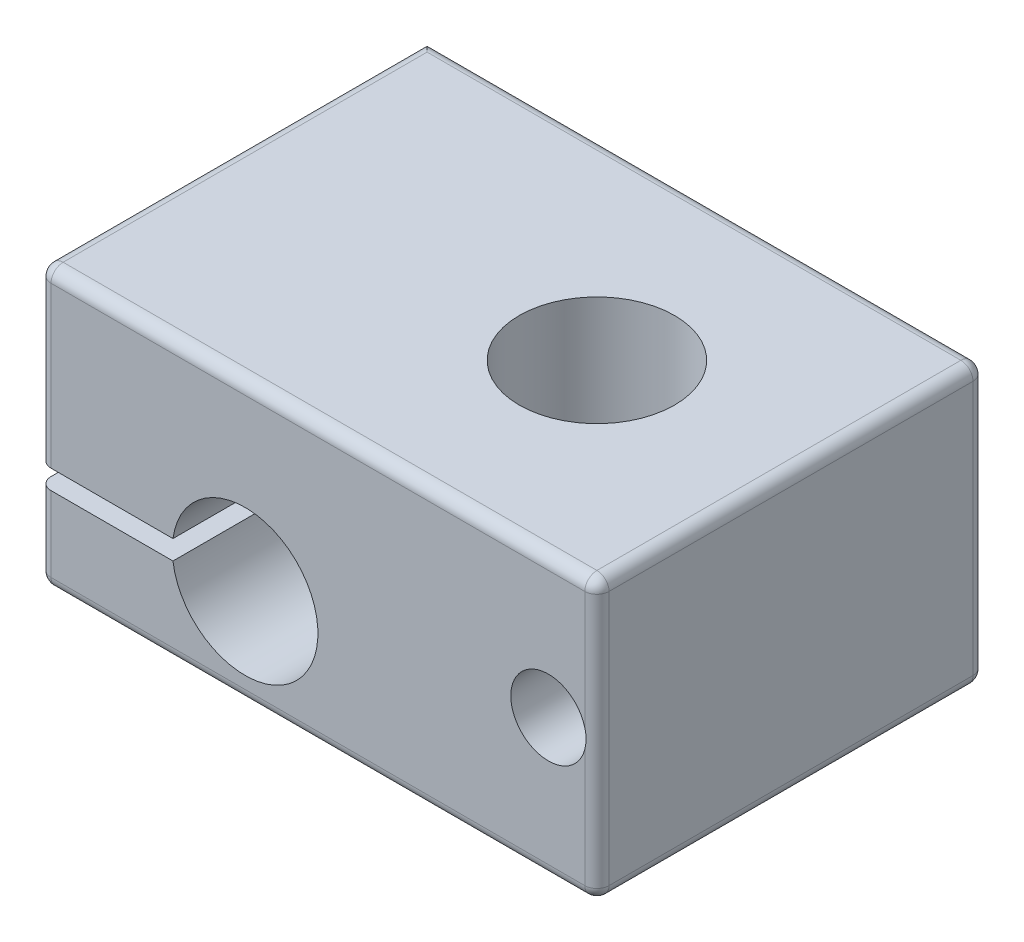
ISO-10303-21;
HEADER;
FILE_DESCRIPTION(('STEP AP214'),'2;1');
FILE_NAME('part.step','',(''),(''),'','','');
FILE_SCHEMA(('AUTOMOTIVE_DESIGN { 1 0 10303 214 1 1 1 1 }'));
ENDSEC;
DATA;
#1=APPLICATION_CONTEXT('core data for automotive mechanical design processes');
#2=APPLICATION_PROTOCOL_DEFINITION('international standard','automotive_design',2000,#1);
#3=PRODUCT_CONTEXT('',#1,'mechanical');
#4=PRODUCT('Part','Part','',(#3));
#5=PRODUCT_RELATED_PRODUCT_CATEGORY('part','',(#4));
#6=PRODUCT_DEFINITION_FORMATION('','',#4);
#7=PRODUCT_DEFINITION_CONTEXT('part definition',#1,'design');
#8=PRODUCT_DEFINITION('design','',#6,#7);
#9=PRODUCT_DEFINITION_SHAPE('','',#8);
#10=(LENGTH_UNIT() NAMED_UNIT(*) SI_UNIT(.MILLI.,.METRE.));
#11=(NAMED_UNIT(*) PLANE_ANGLE_UNIT() SI_UNIT($,.RADIAN.));
#12=(NAMED_UNIT(*) SI_UNIT($,.STERADIAN.) SOLID_ANGLE_UNIT());
#13=UNCERTAINTY_MEASURE_WITH_UNIT(LENGTH_MEASURE(1.E-05),#10,'distance_accuracy_value','');
#14=(GEOMETRIC_REPRESENTATION_CONTEXT(3) GLOBAL_UNCERTAINTY_ASSIGNED_CONTEXT((#13)) GLOBAL_UNIT_ASSIGNED_CONTEXT((#10,
#11,#12)) REPRESENTATION_CONTEXT('',''));
#15=CARTESIAN_POINT('',(0.,0.,0.));
#16=DIRECTION('',(0.,0.,1.));
#17=DIRECTION('',(1.,0.,0.));
#18=AXIS2_PLACEMENT_3D('',#15,#16,#17);
#19=CARTESIAN_POINT('',(-11.5,11.5,8.));
#20=DIRECTION('',(1.,0.,0.));
#21=DIRECTION('',(0.,0.,-1.));
#22=AXIS2_PLACEMENT_3D('',#19,#20,#21);
#23=PLANE('',#22);
#24=DIRECTION('',(0.,0.,1.));
#25=VECTOR('',#24,1.);
#26=CARTESIAN_POINT('',(-11.5,3.6,-8.00000000000001));
#27=LINE('',#26,#25);
#28=CARTESIAN_POINT('',(-11.5,3.6,-7.5));
#29=VERTEX_POINT('',#28);
#30=CARTESIAN_POINT('',(-11.5,3.6,7.5));
#31=VERTEX_POINT('',#30);
#32=EDGE_CURVE('E240',#29,#31,#27,.T.);
#33=ORIENTED_EDGE('',*,*,#32,.F.);
#34=DIRECTION('',(0.,-1.,0.));
#35=VECTOR('',#34,1.);
#36=CARTESIAN_POINT('',(-11.5,11.5,-7.5));
#37=LINE('',#36,#35);
#38=CARTESIAN_POINT('',(-11.5,0.5,-7.5));
#39=VERTEX_POINT('',#38);
#40=EDGE_CURVE('E295',#29,#39,#37,.T.);
#41=ORIENTED_EDGE('',*,*,#40,.T.);
#42=DIRECTION('',(0.,0.,1.));
#43=VECTOR('',#42,1.);
#44=CARTESIAN_POINT('',(-11.5,0.5,8.));
#45=LINE('',#44,#43);
#46=CARTESIAN_POINT('',(-11.5,0.5,7.5));
#47=VERTEX_POINT('',#46);
#48=EDGE_CURVE('E292',#39,#47,#45,.T.);
#49=ORIENTED_EDGE('',*,*,#48,.T.);
#50=DIRECTION('',(0.,-1.,0.));
#51=VECTOR('',#50,1.);
#52=CARTESIAN_POINT('',(-11.5,11.5,7.5));
#53=LINE('',#52,#51);
#54=EDGE_CURVE('E290',#47,#31,#53,.F.);
#55=ORIENTED_EDGE('',*,*,#54,.T.);
#56=EDGE_LOOP('',(#33,#41,#49,#55));
#57=FACE_BOUND('',#56,.T.);
#58=ADVANCED_FACE('F57',(#57),#23,.F.);
#59=DIRECTION('',(0.,-1.,0.));
#60=VECTOR('',#59,1.);
#61=CARTESIAN_POINT('',(-11.5,11.5,7.5));
#62=LINE('',#61,#60);
#63=CARTESIAN_POINT('',(-11.5,4.4,7.5));
#64=VERTEX_POINT('',#63);
#65=CARTESIAN_POINT('',(-11.5,11.,7.5));
#66=VERTEX_POINT('',#65);
#67=EDGE_CURVE('E74',#64,#66,#62,.F.);
#68=ORIENTED_EDGE('',*,*,#67,.T.);
#69=DIRECTION('',(0.,0.,1.));
#70=VECTOR('',#69,1.);
#71=CARTESIAN_POINT('',(-11.5,11.,-8.));
#72=LINE('',#71,#70);
#73=CARTESIAN_POINT('',(-11.5,11.,-8.));
#74=VERTEX_POINT('',#73);
#75=EDGE_CURVE('E325',#66,#74,#72,.F.);
#76=ORIENTED_EDGE('',*,*,#75,.T.);
#77=DIRECTION('',(0.,-1.,0.));
#78=VECTOR('',#77,1.);
#79=CARTESIAN_POINT('',(-11.5,11.5,-8.));
#80=LINE('',#79,#78);
#81=CARTESIAN_POINT('',(-11.5,4.4,-8.));
#82=VERTEX_POINT('',#81);
#83=EDGE_CURVE('E239',#74,#82,#80,.T.);
#84=ORIENTED_EDGE('',*,*,#83,.T.);
#85=DIRECTION('',(0.,0.,1.));
#86=VECTOR('',#85,1.);
#87=CARTESIAN_POINT('',(-11.5,4.4,-8.00000000000001));
#88=LINE('',#87,#86);
#89=EDGE_CURVE('E204',#82,#64,#88,.T.);
#90=ORIENTED_EDGE('',*,*,#89,.T.);
#91=EDGE_LOOP('',(#68,#76,#84,#90));
#92=FACE_BOUND('',#91,.T.);
#93=ADVANCED_FACE('F371',(#92),#23,.F.);
#94=CARTESIAN_POINT('',(11.5,11.5,8.));
#95=DIRECTION('',(0.,0.,-1.));
#96=DIRECTION('',(-1.,0.,0.));
#97=AXIS2_PLACEMENT_3D('',#94,#95,#96);
#98=PLANE('',#97);
#99=DIRECTION('',(1.,0.,0.));
#100=VECTOR('',#99,1.);
#101=CARTESIAN_POINT('',(11.5,0.5,8.));
#102=LINE('',#101,#100);
#103=CARTESIAN_POINT('',(-11.,0.5,8.));
#104=VERTEX_POINT('',#103);
#105=CARTESIAN_POINT('',(11.,0.5,8.));
#106=VERTEX_POINT('',#105);
#107=EDGE_CURVE('E306',#104,#106,#102,.T.);
#108=ORIENTED_EDGE('',*,*,#107,.T.);
#109=DIRECTION('',(0.,-1.,0.));
#110=VECTOR('',#109,1.);
#111=CARTESIAN_POINT('',(11.,11.5,8.));
#112=LINE('',#111,#110);
#113=CARTESIAN_POINT('',(11.,5.35948751620466,8.));
#114=VERTEX_POINT('',#113);
#115=EDGE_CURVE('E309',#106,#114,#112,.F.);
#116=ORIENTED_EDGE('',*,*,#115,.T.);
#117=CARTESIAN_POINT('',(9.5,5.75,8.));
#118=DIRECTION('',(0.,0.,1.));
#119=DIRECTION('',(1.,0.,0.));
#120=AXIS2_PLACEMENT_3D('',#117,#118,#119);
#121=CIRCLE('',#120,1.55);
#122=CARTESIAN_POINT('',(11.,6.14051248379534,8.));
#123=VERTEX_POINT('',#122);
#124=EDGE_CURVE('E249',#123,#114,#121,.T.);
#125=ORIENTED_EDGE('',*,*,#124,.F.);
#126=DIRECTION('',(0.,-1.,0.));
#127=VECTOR('',#126,1.);
#128=CARTESIAN_POINT('',(11.,11.5,8.));
#129=LINE('',#128,#127);
#130=CARTESIAN_POINT('',(11.,11.,8.));
#131=VERTEX_POINT('',#130);
#132=EDGE_CURVE('E302',#123,#131,#129,.F.);
#133=ORIENTED_EDGE('',*,*,#132,.T.);
#134=DIRECTION('',(1.,0.,0.));
#135=VECTOR('',#134,1.);
#136=CARTESIAN_POINT('',(-11.5,11.,8.));
#137=LINE('',#136,#135);
#138=CARTESIAN_POINT('',(-11.,11.,8.));
#139=VERTEX_POINT('',#138);
#140=EDGE_CURVE('E299',#131,#139,#137,.F.);
#141=ORIENTED_EDGE('',*,*,#140,.T.);
#142=DIRECTION('',(0.,-1.,0.));
#143=VECTOR('',#142,1.);
#144=CARTESIAN_POINT('',(-11.,11.5,8.));
#145=LINE('',#144,#143);
#146=CARTESIAN_POINT('',(-11.,4.4,8.));
#147=VERTEX_POINT('',#146);
#148=EDGE_CURVE('E297',#139,#147,#145,.T.);
#149=ORIENTED_EDGE('',*,*,#148,.T.);
#150=DIRECTION('',(-1.,0.,0.));
#151=VECTOR('',#150,1.);
#152=CARTESIAN_POINT('',(-5.9732137494637,4.4,8.));
#153=LINE('',#152,#151);
#154=CARTESIAN_POINT('',(-5.9732137494637,4.4,8.));
#155=VERTEX_POINT('',#154);
#156=EDGE_CURVE('E223',#155,#147,#153,.T.);
#157=ORIENTED_EDGE('',*,*,#156,.F.);
#158=CARTESIAN_POINT('',(-3.,4.,8.));
#159=DIRECTION('',(0.,0.,1.));
#160=DIRECTION('',(1.,0.,0.));
#161=AXIS2_PLACEMENT_3D('',#158,#159,#160);
#162=CIRCLE('',#161,3.);
#163=CARTESIAN_POINT('',(-5.9732137494637,3.6,8.));
#164=VERTEX_POINT('',#163);
#165=EDGE_CURVE('E201',#164,#155,#162,.T.);
#166=ORIENTED_EDGE('',*,*,#165,.F.);
#167=DIRECTION('',(1.,0.,0.));
#168=VECTOR('',#167,1.);
#169=CARTESIAN_POINT('',(-11.5,3.6,8.));
#170=LINE('',#169,#168);
#171=CARTESIAN_POINT('',(-11.,3.6,8.));
#172=VERTEX_POINT('',#171);
#173=EDGE_CURVE('E218',#172,#164,#170,.T.);
#174=ORIENTED_EDGE('',*,*,#173,.F.);
#175=DIRECTION('',(0.,-1.,0.));
#176=VECTOR('',#175,1.);
#177=CARTESIAN_POINT('',(-11.,11.5,8.));
#178=LINE('',#177,#176);
#179=EDGE_CURVE('E304',#172,#104,#178,.T.);
#180=ORIENTED_EDGE('',*,*,#179,.T.);
#181=EDGE_LOOP('',(#108,#116,#125,#133,#141,#149,#157,#166,#174,#180));
#182=FACE_BOUND('',#181,.T.);
#183=ADVANCED_FACE('F367',(#182),#98,.F.);
#184=CARTESIAN_POINT('',(11.5,11.5,8.));
#185=DIRECTION('',(-1.,0.,0.));
#186=DIRECTION('',(0.,0.,1.));
#187=AXIS2_PLACEMENT_3D('',#184,#185,#186);
#188=PLANE('',#187);
#189=DIRECTION('',(0.,0.,-1.));
#190=VECTOR('',#189,1.);
#191=CARTESIAN_POINT('',(11.5,0.5,8.));
#192=LINE('',#191,#190);
#193=CARTESIAN_POINT('',(11.5,0.5,7.5));
#194=VERTEX_POINT('',#193);
#195=CARTESIAN_POINT('',(11.5,0.5,-7.50000000000001));
#196=VERTEX_POINT('',#195);
#197=EDGE_CURVE('E259',#194,#196,#192,.T.);
#198=ORIENTED_EDGE('',*,*,#197,.T.);
#199=DIRECTION('',(0.,-1.,0.));
#200=VECTOR('',#199,1.);
#201=CARTESIAN_POINT('',(11.5,11.5,-7.50000000000001));
#202=LINE('',#201,#200);
#203=CARTESIAN_POINT('',(11.5,11.,-7.50000000000001));
#204=VERTEX_POINT('',#203);
#205=EDGE_CURVE('E263',#196,#204,#202,.F.);
#206=ORIENTED_EDGE('',*,*,#205,.T.);
#207=DIRECTION('',(0.,0.,-1.));
#208=VECTOR('',#207,1.);
#209=CARTESIAN_POINT('',(11.5,11.,8.));
#210=LINE('',#209,#208);
#211=CARTESIAN_POINT('',(11.5,11.,7.5));
#212=VERTEX_POINT('',#211);
#213=EDGE_CURVE('E257',#204,#212,#210,.F.);
#214=ORIENTED_EDGE('',*,*,#213,.T.);
#215=DIRECTION('',(0.,-1.,0.));
#216=VECTOR('',#215,1.);
#217=CARTESIAN_POINT('',(11.5,11.5,7.5));
#218=LINE('',#217,#216);
#219=EDGE_CURVE('E255',#212,#194,#218,.T.);
#220=ORIENTED_EDGE('',*,*,#219,.T.);
#221=EDGE_LOOP('',(#198,#206,#214,#220));
#222=FACE_BOUND('',#221,.T.);
#223=ADVANCED_FACE('F364',(#222),#188,.F.);
#224=CARTESIAN_POINT('',(11.5,11.5,-8.00000000000001));
#225=DIRECTION('',(0.,0.,1.));
#226=DIRECTION('',(1.,0.,0.));
#227=AXIS2_PLACEMENT_3D('',#224,#225,#226);
#228=PLANE('',#227);
#229=ORIENTED_EDGE('',*,*,#83,.F.);
#230=DIRECTION('',(-1.,0.,0.));
#231=VECTOR('',#230,1.);
#232=CARTESIAN_POINT('',(11.5,11.,-8.00000000000001));
#233=LINE('',#232,#231);
#234=CARTESIAN_POINT('',(11.,11.,-8.00000000000001));
#235=VERTEX_POINT('',#234);
#236=EDGE_CURVE('E288',#74,#235,#233,.F.);
#237=ORIENTED_EDGE('',*,*,#236,.T.);
#238=DIRECTION('',(0.,-1.,0.));
#239=VECTOR('',#238,1.);
#240=CARTESIAN_POINT('',(11.,11.5,-8.00000000000001));
#241=LINE('',#240,#239);
#242=CARTESIAN_POINT('',(11.,6.14051248379545,-8.00000000000001));
#243=VERTEX_POINT('',#242);
#244=EDGE_CURVE('E286',#235,#243,#241,.T.);
#245=ORIENTED_EDGE('',*,*,#244,.T.);
#246=CARTESIAN_POINT('',(9.5,5.75,-8.00000000000001));
#247=DIRECTION('',(0.,0.,1.));
#248=DIRECTION('',(1.,0.,0.));
#249=AXIS2_PLACEMENT_3D('',#246,#247,#248);
#250=CIRCLE('',#249,1.55);
#251=CARTESIAN_POINT('',(11.,5.35948751620455,-8.00000000000001));
#252=VERTEX_POINT('',#251);
#253=EDGE_CURVE('E233',#243,#252,#250,.T.);
#254=ORIENTED_EDGE('',*,*,#253,.T.);
#255=DIRECTION('',(0.,-1.,0.));
#256=VECTOR('',#255,1.);
#257=CARTESIAN_POINT('',(11.,11.5,-8.00000000000001));
#258=LINE('',#257,#256);
#259=CARTESIAN_POINT('',(11.,0.5,-8.00000000000001));
#260=VERTEX_POINT('',#259);
#261=EDGE_CURVE('E284',#252,#260,#258,.T.);
#262=ORIENTED_EDGE('',*,*,#261,.T.);
#263=DIRECTION('',(-1.,0.,0.));
#264=VECTOR('',#263,1.);
#265=CARTESIAN_POINT('',(11.5,0.5,-8.00000000000001));
#266=LINE('',#265,#264);
#267=CARTESIAN_POINT('',(-11.,0.5,-8.));
#268=VERTEX_POINT('',#267);
#269=EDGE_CURVE('E280',#260,#268,#266,.T.);
#270=ORIENTED_EDGE('',*,*,#269,.T.);
#271=DIRECTION('',(0.,-1.,0.));
#272=VECTOR('',#271,1.);
#273=CARTESIAN_POINT('',(-11.,11.5,-8.));
#274=LINE('',#273,#272);
#275=CARTESIAN_POINT('',(-11.,3.6,-8.00000000000001));
#276=VERTEX_POINT('',#275);
#277=EDGE_CURVE('E278',#268,#276,#274,.F.);
#278=ORIENTED_EDGE('',*,*,#277,.T.);
#279=DIRECTION('',(1.,0.,0.));
#280=VECTOR('',#279,1.);
#281=CARTESIAN_POINT('',(-11.5,3.6,-8.00000000000001));
#282=LINE('',#281,#280);
#283=CARTESIAN_POINT('',(-5.9732137494637,3.6,-8.00000000000001));
#284=VERTEX_POINT('',#283);
#285=EDGE_CURVE('E205',#276,#284,#282,.T.);
#286=ORIENTED_EDGE('',*,*,#285,.T.);
#287=CARTESIAN_POINT('',(-3.,4.,-8.00000000000001));
#288=DIRECTION('',(0.,0.,1.));
#289=DIRECTION('',(1.,0.,0.));
#290=AXIS2_PLACEMENT_3D('',#287,#288,#289);
#291=CIRCLE('',#290,3.);
#292=CARTESIAN_POINT('',(-5.9732137494637,4.4,-8.00000000000001));
#293=VERTEX_POINT('',#292);
#294=EDGE_CURVE('E199',#284,#293,#291,.T.);
#295=ORIENTED_EDGE('',*,*,#294,.T.);
#296=DIRECTION('',(-1.,0.,0.));
#297=VECTOR('',#296,1.);
#298=CARTESIAN_POINT('',(-5.9732137494637,4.4,-8.00000000000001));
#299=LINE('',#298,#297);
#300=EDGE_CURVE('E208',#293,#82,#299,.T.);
#301=ORIENTED_EDGE('',*,*,#300,.T.);
#302=EDGE_LOOP('',(#229,#237,#245,#254,#262,#270,#278,#286,#295,#301));
#303=FACE_BOUND('',#302,.T.);
#304=ADVANCED_FACE('F214',(#303),#228,.F.);
#305=CARTESIAN_POINT('',(0.,11.5,0.));
#306=DIRECTION('',(0.,1.,0.));
#307=DIRECTION('',(0.,0.,1.));
#308=AXIS2_PLACEMENT_3D('',#305,#306,#307);
#309=PLANE('',#308);
#310=CARTESIAN_POINT('',(3.5,11.5,0.));
#311=DIRECTION('',(0.,-1.,0.));
#312=DIRECTION('',(0.,0.,-1.));
#313=AXIS2_PLACEMENT_3D('',#310,#311,#312);
#314=CIRCLE('',#313,3.2);
#315=CARTESIAN_POINT('',(3.5,11.5,-3.2));
#316=VERTEX_POINT('',#315);
#317=EDGE_CURVE('E226',#316,#316,#314,.T.);
#318=ORIENTED_EDGE('',*,*,#317,.T.);
#319=EDGE_LOOP('',(#318));
#320=FACE_BOUND('',#319,.T.);
#321=DIRECTION('',(0.,0.,-1.));
#322=VECTOR('',#321,1.);
#323=CARTESIAN_POINT('',(11.,11.5,-8.00000000000001));
#324=LINE('',#323,#322);
#325=CARTESIAN_POINT('',(11.,11.5,7.5));
#326=VERTEX_POINT('',#325);
#327=CARTESIAN_POINT('',(11.,11.5,-7.50000000000001));
#328=VERTEX_POINT('',#327);
#329=EDGE_CURVE('E317',#326,#328,#324,.T.);
#330=ORIENTED_EDGE('',*,*,#329,.T.);
#331=DIRECTION('',(-1.,0.,0.));
#332=VECTOR('',#331,1.);
#333=CARTESIAN_POINT('',(-11.5,11.5,-7.5));
#334=LINE('',#333,#332);
#335=CARTESIAN_POINT('',(-11.,11.5,-7.5));
#336=VERTEX_POINT('',#335);
#337=EDGE_CURVE('E319',#328,#336,#334,.T.);
#338=ORIENTED_EDGE('',*,*,#337,.T.);
#339=DIRECTION('',(0.,0.,1.));
#340=VECTOR('',#339,1.);
#341=CARTESIAN_POINT('',(-11.,11.5,8.));
#342=LINE('',#341,#340);
#343=CARTESIAN_POINT('',(-11.,11.5,7.5));
#344=VERTEX_POINT('',#343);
#345=EDGE_CURVE('E314',#336,#344,#342,.T.);
#346=ORIENTED_EDGE('',*,*,#345,.T.);
#347=DIRECTION('',(1.,0.,0.));
#348=VECTOR('',#347,1.);
#349=CARTESIAN_POINT('',(11.5,11.5,7.5));
#350=LINE('',#349,#348);
#351=EDGE_CURVE('E311',#344,#326,#350,.T.);
#352=ORIENTED_EDGE('',*,*,#351,.T.);
#353=EDGE_LOOP('',(#330,#338,#346,#352));
#354=FACE_BOUND('',#353,.T.);
#355=ADVANCED_FACE('F354',(#320,#354),#309,.T.);
#356=CARTESIAN_POINT('',(0.,0.,0.));
#357=DIRECTION('',(0.,1.,0.));
#358=DIRECTION('',(0.,0.,1.));
#359=AXIS2_PLACEMENT_3D('',#356,#357,#358);
#360=PLANE('',#359);
#361=CARTESIAN_POINT('',(-9.,0.,0.));
#362=DIRECTION('',(0.,-1.,0.));
#363=DIRECTION('',(0.,0.,-1.));
#364=AXIS2_PLACEMENT_3D('',#361,#362,#363);
#365=CIRCLE('',#364,1.25);
#366=CARTESIAN_POINT('',(-9.,0.,-1.25));
#367=VERTEX_POINT('',#366);
#368=EDGE_CURVE('E582',#367,#367,#365,.T.);
#369=ORIENTED_EDGE('',*,*,#368,.F.);
#370=EDGE_LOOP('',(#369));
#371=FACE_BOUND('',#370,.T.);
#372=CARTESIAN_POINT('',(3.5,0.,0.));
#373=DIRECTION('',(0.,-1.,0.));
#374=DIRECTION('',(0.,0.,-1.));
#375=AXIS2_PLACEMENT_3D('',#372,#373,#374);
#376=CIRCLE('',#375,3.2);
#377=CARTESIAN_POINT('',(3.5,0.,-3.2));
#378=VERTEX_POINT('',#377);
#379=EDGE_CURVE('E586',#378,#378,#376,.T.);
#380=ORIENTED_EDGE('',*,*,#379,.F.);
#381=EDGE_LOOP('',(#380));
#382=FACE_BOUND('',#381,.T.);
#383=DIRECTION('',(-1.,0.,0.));
#384=VECTOR('',#383,1.);
#385=CARTESIAN_POINT('',(0.,0.,-7.50000000000001));
#386=LINE('',#385,#384);
#387=CARTESIAN_POINT('',(-11.,0.,-7.5));
#388=VERTEX_POINT('',#387);
#389=CARTESIAN_POINT('',(11.,0.,-7.50000000000001));
#390=VERTEX_POINT('',#389);
#391=EDGE_CURVE('E271',#388,#390,#386,.F.);
#392=ORIENTED_EDGE('',*,*,#391,.T.);
#393=DIRECTION('',(0.,0.,-1.));
#394=VECTOR('',#393,1.);
#395=CARTESIAN_POINT('',(11.,0.,0.));
#396=LINE('',#395,#394);
#397=CARTESIAN_POINT('',(11.,0.,7.5));
#398=VERTEX_POINT('',#397);
#399=EDGE_CURVE('E274',#390,#398,#396,.F.);
#400=ORIENTED_EDGE('',*,*,#399,.T.);
#401=DIRECTION('',(1.,0.,0.));
#402=VECTOR('',#401,1.);
#403=CARTESIAN_POINT('',(0.,0.,7.5));
#404=LINE('',#403,#402);
#405=CARTESIAN_POINT('',(-11.,0.,7.5));
#406=VERTEX_POINT('',#405);
#407=EDGE_CURVE('E265',#398,#406,#404,.F.);
#408=ORIENTED_EDGE('',*,*,#407,.T.);
#409=DIRECTION('',(0.,0.,1.));
#410=VECTOR('',#409,1.);
#411=CARTESIAN_POINT('',(-11.,0.,0.));
#412=LINE('',#411,#410);
#413=EDGE_CURVE('E268',#406,#388,#412,.F.);
#414=ORIENTED_EDGE('',*,*,#413,.T.);
#415=EDGE_LOOP('',(#392,#400,#408,#414));
#416=FACE_BOUND('',#415,.T.);
#417=ADVANCED_FACE('F351',(#371,#382,#416),#360,.F.);
#418=CARTESIAN_POINT('',(9.5,5.75,-8.00000000000001));
#419=DIRECTION('',(0.,0.,1.));
#420=DIRECTION('',(1.,0.,0.));
#421=AXIS2_PLACEMENT_3D('',#418,#419,#420);
#422=CYLINDRICAL_SURFACE('',#421,1.55);
#423=ORIENTED_EDGE('',*,*,#253,.F.);
#424=CARTESIAN_POINT('',(11.,6.14051248379545,-8.00000000000001));
#425=CARTESIAN_POINT('',(11.0108024363838,6.09903552413682,-7.99996232481516));
#426=CARTESIAN_POINT('',(11.0198759058637,6.05711135223167,-7.99964848386953));
#427=CARTESIAN_POINT('',(11.0345240738458,5.97264402721695,-7.99887074398072));
#428=CARTESIAN_POINT('',(11.0400977040238,5.93010068915798,-7.99840679928385));
#429=CARTESIAN_POINT('',(11.047620975003,5.84556958162029,-7.99773854454607));
#430=CARTESIAN_POINT('',(11.0496424100898,5.80358824759045,-7.99752911796401));
#431=CARTESIAN_POINT('',(11.0502707206026,5.71961912786192,-7.99746704711206));
#432=CARTESIAN_POINT('',(11.0488789720566,5.67763135158482,-7.99761425906275));
#433=CARTESIAN_POINT('',(11.0423595828868,5.5894219840096,-7.9982149202419));
#434=CARTESIAN_POINT('',(11.0368482998206,5.54322786616299,-7.99869943833373));
#435=CARTESIAN_POINT('',(11.0254459616553,5.47419614350864,-7.99936611817425));
#436=CARTESIAN_POINT('',(11.0210879592181,5.45109533823168,-7.99957938914738));
#437=CARTESIAN_POINT('',(11.0113261293835,5.40511525889383,-7.99989513624747));
#438=CARTESIAN_POINT('',(11.0059223101823,5.38223598309824,-7.99999761324271));
#439=CARTESIAN_POINT('',(11.,5.35948751620455,-8.00000000000001));
#440=B_SPLINE_CURVE_WITH_KNOTS('',3,(#424,#425,#426,#427,#428,#429,#430,#431,#432,#433,#434,
#435,#436,#437,#438,#439),.UNSPECIFIED.,.F.,.F.,(4,2,2,2,2,2,2,4),(0.,0.128541081598051,
0.257121381248515,0.383071660650456,0.508971171439499,0.648335928784881,0.718842682401475,
0.789348883465183),.UNSPECIFIED.);
#441=EDGE_CURVE('E336',#243,#252,#440,.T.);
#442=ORIENTED_EDGE('',*,*,#441,.T.);
#443=EDGE_LOOP('',(#423,#442));
#444=FACE_BOUND('',#443,.T.);
#445=ORIENTED_EDGE('',*,*,#124,.T.);
#446=CARTESIAN_POINT('',(11.,5.35948751620466,8.));
#447=CARTESIAN_POINT('',(11.0108024363838,5.40096447586329,7.99996232481515));
#448=CARTESIAN_POINT('',(11.0198759058637,5.44288864776844,7.99964848386952));
#449=CARTESIAN_POINT('',(11.0345240738458,5.52735597278316,7.99887074398071));
#450=CARTESIAN_POINT('',(11.0400977040238,5.56989931084213,7.99840679928385));
#451=CARTESIAN_POINT('',(11.047620975003,5.65443041837982,7.99773854454606));
#452=CARTESIAN_POINT('',(11.0496424100898,5.69641175240966,7.997529117964));
#453=CARTESIAN_POINT('',(11.0502707206026,5.78038087213818,7.99746704711205));
#454=CARTESIAN_POINT('',(11.0488789720566,5.82236864841529,7.99761425906274));
#455=CARTESIAN_POINT('',(11.0423595828868,5.91057801599048,7.9982149202419));
#456=CARTESIAN_POINT('',(11.0368482998206,5.95677213383704,7.99869943833372));
#457=CARTESIAN_POINT('',(11.0254459616553,6.02580385649134,7.99936611817424));
#458=CARTESIAN_POINT('',(11.0210879592182,6.04890466176828,7.99957938914737));
#459=CARTESIAN_POINT('',(11.0113261293835,6.0948847411061,7.99989513624746));
#460=CARTESIAN_POINT('',(11.0059223101823,6.11776401690167,7.99999761324269));
#461=CARTESIAN_POINT('',(11.,6.14051248379534,8.));
#462=B_SPLINE_CURVE_WITH_KNOTS('',3,(#446,#447,#448,#449,#450,#451,#452,#453,#454,#455,#456,
#457,#458,#459,#460,#461),.UNSPECIFIED.,.F.,.F.,(4,2,2,2,2,2,2,4),(0.,0.12854108159805,
0.257121381248514,0.383071660650456,0.508971171439498,0.648335928784772,0.718842682401311,
0.789348883464963),.UNSPECIFIED.);
#463=EDGE_CURVE('E328',#114,#123,#462,.T.);
#464=ORIENTED_EDGE('',*,*,#463,.T.);
#465=EDGE_LOOP('',(#445,#464));
#466=FACE_BOUND('',#465,.T.);
#467=ADVANCED_FACE('F346',(#444,#466),#422,.F.);
#468=CARTESIAN_POINT('',(-3.,4.,-8.00000000000001));
#469=DIRECTION('',(0.,0.,1.));
#470=DIRECTION('',(1.,0.,0.));
#471=AXIS2_PLACEMENT_3D('',#468,#469,#470);
#472=CYLINDRICAL_SURFACE('',#471,3.);
#473=ORIENTED_EDGE('',*,*,#165,.T.);
#474=DIRECTION('',(0.,0.,1.));
#475=VECTOR('',#474,1.);
#476=CARTESIAN_POINT('',(-5.9732137494637,4.4,-8.00000000000001));
#477=LINE('',#476,#475);
#478=EDGE_CURVE('E194',#293,#155,#477,.T.);
#479=ORIENTED_EDGE('',*,*,#478,.F.);
#480=ORIENTED_EDGE('',*,*,#294,.F.);
#481=DIRECTION('',(0.,0.,1.));
#482=VECTOR('',#481,1.);
#483=CARTESIAN_POINT('',(-5.9732137494637,3.6,-8.00000000000001));
#484=LINE('',#483,#482);
#485=EDGE_CURVE('E236',#284,#164,#484,.T.);
#486=ORIENTED_EDGE('',*,*,#485,.T.);
#487=EDGE_LOOP('',(#473,#479,#480,#486));
#488=FACE_BOUND('',#487,.T.);
#489=ADVANCED_FACE('F196',(#488),#472,.F.);
#490=CARTESIAN_POINT('',(-11.5,3.6,-8.00000000000001));
#491=DIRECTION('',(0.,-1.,0.));
#492=DIRECTION('',(0.,0.,-1.));
#493=AXIS2_PLACEMENT_3D('',#490,#491,#492);
#494=PLANE('',#493);
#495=CARTESIAN_POINT('',(-9.,3.6,0.));
#496=DIRECTION('',(0.,-1.,0.));
#497=DIRECTION('',(0.,0.,-1.));
#498=AXIS2_PLACEMENT_3D('',#495,#496,#497);
#499=CIRCLE('',#498,1.25);
#500=CARTESIAN_POINT('',(-9.,3.6,-1.25));
#501=VERTEX_POINT('',#500);
#502=EDGE_CURVE('E61',#501,#501,#499,.T.);
#503=ORIENTED_EDGE('',*,*,#502,.T.);
#504=EDGE_LOOP('',(#503));
#505=FACE_BOUND('',#504,.T.);
#506=ORIENTED_EDGE('',*,*,#285,.F.);
#507=CARTESIAN_POINT('',(-11.,3.6,-7.5));
#508=DIRECTION('',(0.,-1.,0.));
#509=DIRECTION('',(0.,0.,-1.));
#510=AXIS2_PLACEMENT_3D('',#507,#508,#509);
#511=CIRCLE('',#510,0.5);
#512=EDGE_CURVE('E66',#276,#29,#511,.F.);
#513=ORIENTED_EDGE('',*,*,#512,.T.);
#514=ORIENTED_EDGE('',*,*,#32,.T.);
#515=CARTESIAN_POINT('',(-11.,3.6,7.5));
#516=DIRECTION('',(0.,-1.,0.));
#517=DIRECTION('',(0.,0.,-1.));
#518=AXIS2_PLACEMENT_3D('',#515,#516,#517);
#519=CIRCLE('',#518,0.5);
#520=EDGE_CURVE('E501',#31,#172,#519,.F.);
#521=ORIENTED_EDGE('',*,*,#520,.T.);
#522=ORIENTED_EDGE('',*,*,#173,.T.);
#523=ORIENTED_EDGE('',*,*,#485,.F.);
#524=EDGE_LOOP('',(#506,#513,#514,#521,#522,#523));
#525=FACE_BOUND('',#524,.T.);
#526=ADVANCED_FACE('F564',(#505,#525),#494,.F.);
#527=CARTESIAN_POINT('',(-5.9732137494637,4.4,-8.00000000000001));
#528=DIRECTION('',(0.,1.,0.));
#529=DIRECTION('',(0.,0.,1.));
#530=AXIS2_PLACEMENT_3D('',#527,#528,#529);
#531=PLANE('',#530);
#532=ORIENTED_EDGE('',*,*,#156,.T.);
#533=CARTESIAN_POINT('',(-11.,4.4,7.5));
#534=DIRECTION('',(0.,1.,0.));
#535=DIRECTION('',(0.,0.,1.));
#536=AXIS2_PLACEMENT_3D('',#533,#534,#535);
#537=CIRCLE('',#536,0.5);
#538=EDGE_CURVE('E13',#147,#64,#537,.F.);
#539=ORIENTED_EDGE('',*,*,#538,.T.);
#540=ORIENTED_EDGE('',*,*,#89,.F.);
#541=ORIENTED_EDGE('',*,*,#300,.F.);
#542=ORIENTED_EDGE('',*,*,#478,.T.);
#543=EDGE_LOOP('',(#532,#539,#540,#541,#542));
#544=FACE_BOUND('',#543,.T.);
#545=ADVANCED_FACE('F209',(#544),#531,.F.);
#546=CARTESIAN_POINT('',(-11.,11.5,7.5));
#547=DIRECTION('',(0.,-1.,0.));
#548=DIRECTION('',(0.,0.,-1.));
#549=AXIS2_PLACEMENT_3D('',#546,#547,#548);
#550=CYLINDRICAL_SURFACE('',#549,0.5);
#551=CARTESIAN_POINT('',(-11.,11.,7.5));
#552=DIRECTION('',(0.,1.,0.));
#553=DIRECTION('',(0.,0.,1.));
#554=AXIS2_PLACEMENT_3D('',#551,#552,#553);
#555=CIRCLE('',#554,0.5);
#556=EDGE_CURVE('E252',#66,#139,#555,.T.);
#557=ORIENTED_EDGE('',*,*,#556,.F.);
#558=ORIENTED_EDGE('',*,*,#67,.F.);
#559=ORIENTED_EDGE('',*,*,#538,.F.);
#560=ORIENTED_EDGE('',*,*,#148,.F.);
#561=EDGE_LOOP('',(#557,#558,#559,#560));
#562=FACE_BOUND('',#561,.T.);
#563=ADVANCED_FACE('F59',(#562),#550,.T.);
#564=CARTESIAN_POINT('',(-11.,11.,7.5));
#565=DIRECTION('',(0.,0.,1.));
#566=DIRECTION('',(1.,0.,0.));
#567=AXIS2_PLACEMENT_3D('',#564,#565,#566);
#568=SPHERICAL_SURFACE('',#567,0.5);
#569=CARTESIAN_POINT('',(-11.,11.,7.5));
#570=DIRECTION('',(-1.,0.,0.));
#571=DIRECTION('',(0.,0.,1.));
#572=AXIS2_PLACEMENT_3D('',#569,#570,#571);
#573=CIRCLE('',#572,0.5);
#574=EDGE_CURVE('E456',#344,#139,#573,.F.);
#575=ORIENTED_EDGE('',*,*,#574,.F.);
#576=CARTESIAN_POINT('',(-11.,11.,7.5));
#577=DIRECTION('',(0.,0.,1.));
#578=DIRECTION('',(1.,0.,0.));
#579=AXIS2_PLACEMENT_3D('',#576,#577,#578);
#580=CIRCLE('',#579,0.5);
#581=EDGE_CURVE('E459',#66,#344,#580,.F.);
#582=ORIENTED_EDGE('',*,*,#581,.F.);
#583=ORIENTED_EDGE('',*,*,#556,.T.);
#584=EDGE_LOOP('',(#575,#582,#583));
#585=FACE_BOUND('',#584,.T.);
#586=ADVANCED_FACE('F465',(#585),#568,.T.);
#587=CARTESIAN_POINT('',(-11.,11.,0.));
#588=DIRECTION('',(0.,0.,-1.));
#589=DIRECTION('',(-1.,0.,0.));
#590=AXIS2_PLACEMENT_3D('',#587,#588,#589);
#591=CYLINDRICAL_SURFACE('',#590,0.5);
#592=ORIENTED_EDGE('',*,*,#581,.T.);
#593=ORIENTED_EDGE('',*,*,#345,.F.);
#594=CARTESIAN_POINT('',(-11.,11.,-7.5));
#595=DIRECTION('',(0.707106781186547,0.,-0.707106781186548));
#596=DIRECTION('',(-0.707106781186548,0.,-0.707106781186547));
#597=AXIS2_PLACEMENT_3D('',#594,#595,#596);
#598=ELLIPSE('',#597,0.707106781186547,0.5);
#599=EDGE_CURVE('E454',#74,#336,#598,.T.);
#600=ORIENTED_EDGE('',*,*,#599,.F.);
#601=ORIENTED_EDGE('',*,*,#75,.F.);
#602=EDGE_LOOP('',(#592,#593,#600,#601));
#603=FACE_BOUND('',#602,.T.);
#604=ADVANCED_FACE('F495',(#603),#591,.T.);
#605=CARTESIAN_POINT('',(-11.,11.5,7.5));
#606=DIRECTION('',(0.,-1.,0.));
#607=DIRECTION('',(0.,0.,-1.));
#608=AXIS2_PLACEMENT_3D('',#605,#606,#607);
#609=CYLINDRICAL_SURFACE('',#608,0.5);
#610=ORIENTED_EDGE('',*,*,#520,.F.);
#611=ORIENTED_EDGE('',*,*,#54,.F.);
#612=CARTESIAN_POINT('',(-11.,0.5,7.5));
#613=DIRECTION('',(0.,-1.,0.));
#614=DIRECTION('',(0.,0.,-1.));
#615=AXIS2_PLACEMENT_3D('',#612,#613,#614);
#616=CIRCLE('',#615,0.5);
#617=EDGE_CURVE('E448',#104,#47,#616,.T.);
#618=ORIENTED_EDGE('',*,*,#617,.F.);
#619=ORIENTED_EDGE('',*,*,#179,.F.);
#620=EDGE_LOOP('',(#610,#611,#618,#619));
#621=FACE_BOUND('',#620,.T.);
#622=ADVANCED_FACE('F552',(#621),#609,.T.);
#623=CARTESIAN_POINT('',(0.,11.,7.5));
#624=DIRECTION('',(-1.,0.,0.));
#625=DIRECTION('',(0.,0.,1.));
#626=AXIS2_PLACEMENT_3D('',#623,#624,#625);
#627=CYLINDRICAL_SURFACE('',#626,0.5);
#628=ORIENTED_EDGE('',*,*,#574,.T.);
#629=ORIENTED_EDGE('',*,*,#140,.F.);
#630=CARTESIAN_POINT('',(11.,11.,7.5));
#631=DIRECTION('',(1.,0.,0.));
#632=DIRECTION('',(0.,0.,-1.));
#633=AXIS2_PLACEMENT_3D('',#630,#631,#632);
#634=CIRCLE('',#633,0.5);
#635=EDGE_CURVE('E445',#326,#131,#634,.T.);
#636=ORIENTED_EDGE('',*,*,#635,.F.);
#637=ORIENTED_EDGE('',*,*,#351,.F.);
#638=EDGE_LOOP('',(#628,#629,#636,#637));
#639=FACE_BOUND('',#638,.T.);
#640=ADVANCED_FACE('F472',(#639),#627,.T.);
#641=CARTESIAN_POINT('',(11.,11.,0.));
#642=DIRECTION('',(0.,0.,1.));
#643=DIRECTION('',(1.,0.,0.));
#644=AXIS2_PLACEMENT_3D('',#641,#642,#643);
#645=CYLINDRICAL_SURFACE('',#644,0.5);
#646=CARTESIAN_POINT('',(11.,11.,-7.50000000000001));
#647=DIRECTION('',(0.,0.,-1.));
#648=DIRECTION('',(-1.,0.,0.));
#649=AXIS2_PLACEMENT_3D('',#646,#647,#648);
#650=CIRCLE('',#649,0.5);
#651=EDGE_CURVE('E439',#328,#204,#650,.T.);
#652=ORIENTED_EDGE('',*,*,#651,.F.);
#653=ORIENTED_EDGE('',*,*,#329,.F.);
#654=CARTESIAN_POINT('',(11.,11.,7.5));
#655=DIRECTION('',(0.,0.,1.));
#656=DIRECTION('',(1.,0.,0.));
#657=AXIS2_PLACEMENT_3D('',#654,#655,#656);
#658=CIRCLE('',#657,0.5);
#659=EDGE_CURVE('E442',#212,#326,#658,.T.);
#660=ORIENTED_EDGE('',*,*,#659,.F.);
#661=ORIENTED_EDGE('',*,*,#213,.F.);
#662=EDGE_LOOP('',(#652,#653,#660,#661));
#663=FACE_BOUND('',#662,.T.);
#664=ADVANCED_FACE('F481',(#663),#645,.T.);
#665=CARTESIAN_POINT('',(0.,11.,-7.50000000000001));
#666=DIRECTION('',(1.,0.,0.));
#667=DIRECTION('',(0.,0.,-1.));
#668=AXIS2_PLACEMENT_3D('',#665,#666,#667);
#669=CYLINDRICAL_SURFACE('',#668,0.5);
#670=ORIENTED_EDGE('',*,*,#599,.T.);
#671=ORIENTED_EDGE('',*,*,#337,.F.);
#672=CARTESIAN_POINT('',(11.,11.,-7.50000000000001));
#673=DIRECTION('',(1.,0.,0.));
#674=DIRECTION('',(0.,0.,-1.));
#675=AXIS2_PLACEMENT_3D('',#672,#673,#674);
#676=CIRCLE('',#675,0.5);
#677=EDGE_CURVE('E421',#235,#328,#676,.T.);
#678=ORIENTED_EDGE('',*,*,#677,.F.);
#679=ORIENTED_EDGE('',*,*,#236,.F.);
#680=EDGE_LOOP('',(#670,#671,#678,#679));
#681=FACE_BOUND('',#680,.T.);
#682=ADVANCED_FACE('F492',(#681),#669,.T.);
#683=CARTESIAN_POINT('',(-11.,11.5,-7.5));
#684=DIRECTION('',(0.,-1.,0.));
#685=DIRECTION('',(0.,0.,-1.));
#686=AXIS2_PLACEMENT_3D('',#683,#684,#685);
#687=CYLINDRICAL_SURFACE('',#686,0.5);
#688=ORIENTED_EDGE('',*,*,#512,.F.);
#689=ORIENTED_EDGE('',*,*,#277,.F.);
#690=CARTESIAN_POINT('',(-11.,0.5,-7.5));
#691=DIRECTION('',(0.,-1.,0.));
#692=DIRECTION('',(0.,0.,-1.));
#693=AXIS2_PLACEMENT_3D('',#690,#691,#692);
#694=CIRCLE('',#693,0.5);
#695=EDGE_CURVE('E417',#39,#268,#694,.T.);
#696=ORIENTED_EDGE('',*,*,#695,.F.);
#697=ORIENTED_EDGE('',*,*,#40,.F.);
#698=EDGE_LOOP('',(#688,#689,#696,#697));
#699=FACE_BOUND('',#698,.T.);
#700=ADVANCED_FACE('F414',(#699),#687,.T.);
#701=CARTESIAN_POINT('',(-11.,0.5,8.));
#702=DIRECTION('',(0.,0.,1.));
#703=DIRECTION('',(1.,0.,0.));
#704=AXIS2_PLACEMENT_3D('',#701,#702,#703);
#705=CYLINDRICAL_SURFACE('',#704,0.5);
#706=CARTESIAN_POINT('',(-11.,0.5,7.5));
#707=DIRECTION('',(0.,0.,1.));
#708=DIRECTION('',(1.,0.,0.));
#709=AXIS2_PLACEMENT_3D('',#706,#707,#708);
#710=CIRCLE('',#709,0.5);
#711=EDGE_CURVE('E451',#47,#406,#710,.T.);
#712=ORIENTED_EDGE('',*,*,#711,.F.);
#713=ORIENTED_EDGE('',*,*,#48,.F.);
#714=CARTESIAN_POINT('',(-11.,0.5,-7.5));
#715=DIRECTION('',(0.,0.,-1.));
#716=DIRECTION('',(-1.,0.,0.));
#717=AXIS2_PLACEMENT_3D('',#714,#715,#716);
#718=CIRCLE('',#717,0.5);
#719=EDGE_CURVE('E422',#388,#39,#718,.T.);
#720=ORIENTED_EDGE('',*,*,#719,.F.);
#721=ORIENTED_EDGE('',*,*,#413,.F.);
#722=EDGE_LOOP('',(#712,#713,#720,#721));
#723=FACE_BOUND('',#722,.T.);
#724=ADVANCED_FACE('F537',(#723),#705,.T.);
#725=CARTESIAN_POINT('',(-11.,0.5,7.5));
#726=DIRECTION('',(0.,0.,1.));
#727=DIRECTION('',(1.,0.,0.));
#728=AXIS2_PLACEMENT_3D('',#725,#726,#727);
#729=SPHERICAL_SURFACE('',#728,0.5);
#730=ORIENTED_EDGE('',*,*,#617,.T.);
#731=ORIENTED_EDGE('',*,*,#711,.T.);
#732=CARTESIAN_POINT('',(-11.,0.5,7.5));
#733=DIRECTION('',(-1.,0.,0.));
#734=DIRECTION('',(0.,0.,1.));
#735=AXIS2_PLACEMENT_3D('',#732,#733,#734);
#736=CIRCLE('',#735,0.5);
#737=EDGE_CURVE('E430',#104,#406,#736,.F.);
#738=ORIENTED_EDGE('',*,*,#737,.F.);
#739=EDGE_LOOP('',(#730,#731,#738));
#740=FACE_BOUND('',#739,.T.);
#741=ADVANCED_FACE('F530',(#740),#729,.T.);
#742=CARTESIAN_POINT('',(11.,11.,7.5));
#743=DIRECTION('',(0.,0.,1.));
#744=DIRECTION('',(1.,0.,0.));
#745=AXIS2_PLACEMENT_3D('',#742,#743,#744);
#746=SPHERICAL_SURFACE('',#745,0.5);
#747=ORIENTED_EDGE('',*,*,#659,.T.);
#748=ORIENTED_EDGE('',*,*,#635,.T.);
#749=CARTESIAN_POINT('',(11.,11.,7.5));
#750=DIRECTION('',(0.,1.,0.));
#751=DIRECTION('',(0.,0.,1.));
#752=AXIS2_PLACEMENT_3D('',#749,#750,#751);
#753=CIRCLE('',#752,0.5);
#754=EDGE_CURVE('E433',#212,#131,#753,.F.);
#755=ORIENTED_EDGE('',*,*,#754,.F.);
#756=EDGE_LOOP('',(#747,#748,#755));
#757=FACE_BOUND('',#756,.T.);
#758=ADVANCED_FACE('F528',(#757),#746,.T.);
#759=CARTESIAN_POINT('',(11.,11.,-7.50000000000001));
#760=DIRECTION('',(0.,0.,1.));
#761=DIRECTION('',(1.,0.,0.));
#762=AXIS2_PLACEMENT_3D('',#759,#760,#761);
#763=SPHERICAL_SURFACE('',#762,0.5);
#764=ORIENTED_EDGE('',*,*,#677,.T.);
#765=ORIENTED_EDGE('',*,*,#651,.T.);
#766=CARTESIAN_POINT('',(11.,11.,-7.50000000000001));
#767=DIRECTION('',(0.,1.,0.));
#768=DIRECTION('',(0.,0.,1.));
#769=AXIS2_PLACEMENT_3D('',#766,#767,#768);
#770=CIRCLE('',#769,0.5);
#771=EDGE_CURVE('E488',#235,#204,#770,.F.);
#772=ORIENTED_EDGE('',*,*,#771,.F.);
#773=EDGE_LOOP('',(#764,#765,#772));
#774=FACE_BOUND('',#773,.T.);
#775=ADVANCED_FACE('F487',(#774),#763,.T.);
#776=CARTESIAN_POINT('',(-11.,0.5,-7.5));
#777=DIRECTION('',(0.,0.,1.));
#778=DIRECTION('',(1.,0.,0.));
#779=AXIS2_PLACEMENT_3D('',#776,#777,#778);
#780=SPHERICAL_SURFACE('',#779,0.5);
#781=ORIENTED_EDGE('',*,*,#719,.T.);
#782=ORIENTED_EDGE('',*,*,#695,.T.);
#783=CARTESIAN_POINT('',(-11.,0.5,-7.5));
#784=DIRECTION('',(-1.,0.,0.));
#785=DIRECTION('',(0.,0.,1.));
#786=AXIS2_PLACEMENT_3D('',#783,#784,#785);
#787=CIRCLE('',#786,0.5);
#788=EDGE_CURVE('E426',#388,#268,#787,.F.);
#789=ORIENTED_EDGE('',*,*,#788,.F.);
#790=EDGE_LOOP('',(#781,#782,#789));
#791=FACE_BOUND('',#790,.T.);
#792=ADVANCED_FACE('F425',(#791),#780,.T.);
#793=CARTESIAN_POINT('',(11.5,0.5,7.5));
#794=DIRECTION('',(1.,0.,0.));
#795=DIRECTION('',(0.,0.,-1.));
#796=AXIS2_PLACEMENT_3D('',#793,#794,#795);
#797=CYLINDRICAL_SURFACE('',#796,0.5);
#798=ORIENTED_EDGE('',*,*,#737,.T.);
#799=ORIENTED_EDGE('',*,*,#407,.F.);
#800=CARTESIAN_POINT('',(11.,0.5,7.5));
#801=DIRECTION('',(1.,0.,0.));
#802=DIRECTION('',(0.,0.,-1.));
#803=AXIS2_PLACEMENT_3D('',#800,#801,#802);
#804=CIRCLE('',#803,0.5);
#805=EDGE_CURVE('E518',#106,#398,#804,.T.);
#806=ORIENTED_EDGE('',*,*,#805,.F.);
#807=ORIENTED_EDGE('',*,*,#107,.F.);
#808=EDGE_LOOP('',(#798,#799,#806,#807));
#809=FACE_BOUND('',#808,.T.);
#810=ADVANCED_FACE('F398',(#809),#797,.T.);
#811=CARTESIAN_POINT('',(11.,11.5,7.5));
#812=DIRECTION('',(0.,-1.,0.));
#813=DIRECTION('',(0.,0.,-1.));
#814=AXIS2_PLACEMENT_3D('',#811,#812,#813);
#815=CYLINDRICAL_SURFACE('',#814,0.5);
#816=ORIENTED_EDGE('',*,*,#463,.F.);
#817=ORIENTED_EDGE('',*,*,#115,.F.);
#818=CARTESIAN_POINT('',(11.,0.5,7.5));
#819=DIRECTION('',(0.,-1.,0.));
#820=DIRECTION('',(0.,0.,-1.));
#821=AXIS2_PLACEMENT_3D('',#818,#819,#820);
#822=CIRCLE('',#821,0.5);
#823=EDGE_CURVE('E515',#194,#106,#822,.T.);
#824=ORIENTED_EDGE('',*,*,#823,.F.);
#825=ORIENTED_EDGE('',*,*,#219,.F.);
#826=ORIENTED_EDGE('',*,*,#754,.T.);
#827=ORIENTED_EDGE('',*,*,#132,.F.);
#828=EDGE_LOOP('',(#816,#817,#824,#825,#826,#827));
#829=FACE_BOUND('',#828,.T.);
#830=ADVANCED_FACE('F343',(#829),#815,.T.);
#831=CARTESIAN_POINT('',(11.,11.5,-7.50000000000001));
#832=DIRECTION('',(0.,-1.,0.));
#833=DIRECTION('',(0.,0.,-1.));
#834=AXIS2_PLACEMENT_3D('',#831,#832,#833);
#835=CYLINDRICAL_SURFACE('',#834,0.5);
#836=ORIENTED_EDGE('',*,*,#771,.T.);
#837=ORIENTED_EDGE('',*,*,#205,.F.);
#838=CARTESIAN_POINT('',(11.,0.5,-7.50000000000001));
#839=DIRECTION('',(0.,-1.,0.));
#840=DIRECTION('',(0.,0.,-1.));
#841=AXIS2_PLACEMENT_3D('',#838,#839,#840);
#842=CIRCLE('',#841,0.5);
#843=EDGE_CURVE('E512',#260,#196,#842,.T.);
#844=ORIENTED_EDGE('',*,*,#843,.F.);
#845=ORIENTED_EDGE('',*,*,#261,.F.);
#846=ORIENTED_EDGE('',*,*,#441,.F.);
#847=ORIENTED_EDGE('',*,*,#244,.F.);
#848=EDGE_LOOP('',(#836,#837,#844,#845,#846,#847));
#849=FACE_BOUND('',#848,.T.);
#850=ADVANCED_FACE('F390',(#849),#835,.T.);
#851=CARTESIAN_POINT('',(11.5,0.5,-7.50000000000001));
#852=DIRECTION('',(-1.,0.,0.));
#853=DIRECTION('',(0.,0.,1.));
#854=AXIS2_PLACEMENT_3D('',#851,#852,#853);
#855=CYLINDRICAL_SURFACE('',#854,0.5);
#856=ORIENTED_EDGE('',*,*,#788,.T.);
#857=ORIENTED_EDGE('',*,*,#269,.F.);
#858=CARTESIAN_POINT('',(11.,0.5,-7.50000000000001));
#859=DIRECTION('',(1.,0.,0.));
#860=DIRECTION('',(0.,0.,-1.));
#861=AXIS2_PLACEMENT_3D('',#858,#859,#860);
#862=CIRCLE('',#861,0.5);
#863=EDGE_CURVE('E509',#390,#260,#862,.T.);
#864=ORIENTED_EDGE('',*,*,#863,.F.);
#865=ORIENTED_EDGE('',*,*,#391,.F.);
#866=EDGE_LOOP('',(#856,#857,#864,#865));
#867=FACE_BOUND('',#866,.T.);
#868=ADVANCED_FACE('F387',(#867),#855,.T.);
#869=CARTESIAN_POINT('',(11.,0.5,7.5));
#870=DIRECTION('',(0.,0.,1.));
#871=DIRECTION('',(1.,0.,0.));
#872=AXIS2_PLACEMENT_3D('',#869,#870,#871);
#873=SPHERICAL_SURFACE('',#872,0.5);
#874=ORIENTED_EDGE('',*,*,#823,.T.);
#875=ORIENTED_EDGE('',*,*,#805,.T.);
#876=CARTESIAN_POINT('',(11.,0.5,7.5));
#877=DIRECTION('',(0.,0.,1.));
#878=DIRECTION('',(1.,0.,0.));
#879=AXIS2_PLACEMENT_3D('',#876,#877,#878);
#880=CIRCLE('',#879,0.5);
#881=EDGE_CURVE('E507',#194,#398,#880,.F.);
#882=ORIENTED_EDGE('',*,*,#881,.F.);
#883=EDGE_LOOP('',(#874,#875,#882));
#884=FACE_BOUND('',#883,.T.);
#885=ADVANCED_FACE('F383',(#884),#873,.T.);
#886=CARTESIAN_POINT('',(11.,0.5,-7.50000000000001));
#887=DIRECTION('',(0.,0.,1.));
#888=DIRECTION('',(1.,0.,0.));
#889=AXIS2_PLACEMENT_3D('',#886,#887,#888);
#890=SPHERICAL_SURFACE('',#889,0.5);
#891=ORIENTED_EDGE('',*,*,#863,.T.);
#892=ORIENTED_EDGE('',*,*,#843,.T.);
#893=CARTESIAN_POINT('',(11.,0.5,-7.50000000000001));
#894=DIRECTION('',(0.,0.,-1.));
#895=DIRECTION('',(-1.,0.,0.));
#896=AXIS2_PLACEMENT_3D('',#893,#894,#895);
#897=CIRCLE('',#896,0.5);
#898=EDGE_CURVE('E505',#390,#196,#897,.F.);
#899=ORIENTED_EDGE('',*,*,#898,.F.);
#900=EDGE_LOOP('',(#891,#892,#899));
#901=FACE_BOUND('',#900,.T.);
#902=ADVANCED_FACE('F379',(#901),#890,.T.);
#903=CARTESIAN_POINT('',(11.,0.5,8.));
#904=DIRECTION('',(0.,0.,-1.));
#905=DIRECTION('',(-1.,0.,0.));
#906=AXIS2_PLACEMENT_3D('',#903,#904,#905);
#907=CYLINDRICAL_SURFACE('',#906,0.5);
#908=ORIENTED_EDGE('',*,*,#881,.T.);
#909=ORIENTED_EDGE('',*,*,#399,.F.);
#910=ORIENTED_EDGE('',*,*,#898,.T.);
#911=ORIENTED_EDGE('',*,*,#197,.F.);
#912=EDGE_LOOP('',(#908,#909,#910,#911));
#913=FACE_BOUND('',#912,.T.);
#914=ADVANCED_FACE('F375',(#913),#907,.T.);
#915=CARTESIAN_POINT('',(3.5,0.,0.));
#916=DIRECTION('',(0.,-1.,0.));
#917=DIRECTION('',(0.,0.,-1.));
#918=AXIS2_PLACEMENT_3D('',#915,#916,#917);
#919=CYLINDRICAL_SURFACE('',#918,3.2);
#920=ORIENTED_EDGE('',*,*,#317,.F.);
#921=EDGE_LOOP('',(#920));
#922=FACE_BOUND('',#921,.T.);
#923=ORIENTED_EDGE('',*,*,#379,.T.);
#924=EDGE_LOOP('',(#923));
#925=FACE_BOUND('',#924,.T.);
#926=ADVANCED_FACE('F378',(#922,#925),#919,.F.);
#927=CARTESIAN_POINT('',(-9.,0.,0.));
#928=DIRECTION('',(0.,-1.,0.));
#929=DIRECTION('',(0.,0.,-1.));
#930=AXIS2_PLACEMENT_3D('',#927,#928,#929);
#931=CYLINDRICAL_SURFACE('',#930,1.25);
#932=ORIENTED_EDGE('',*,*,#368,.T.);
#933=EDGE_LOOP('',(#932));
#934=FACE_BOUND('',#933,.T.);
#935=ORIENTED_EDGE('',*,*,#502,.F.);
#936=EDGE_LOOP('',(#935));
#937=FACE_BOUND('',#936,.T.);
#938=ADVANCED_FACE('F573',(#934,#937),#931,.F.);
#939=CLOSED_SHELL('',(#58,#93,#183,#223,#304,#355,#417,#467,#489,#526,#545,#563,#586,#604,#622,
#640,#664,#682,#700,#724,#741,#758,#775,#792,#810,#830,#850,#868,#885,#902,#914,#926,#938));
#940=MANIFOLD_SOLID_BREP('B2',#939);
#941=ADVANCED_BREP_SHAPE_REPRESENTATION('',(#18,#940),#14);
#942=SHAPE_DEFINITION_REPRESENTATION(#9,#941);
ENDSEC;
END-ISO-10303-21;
